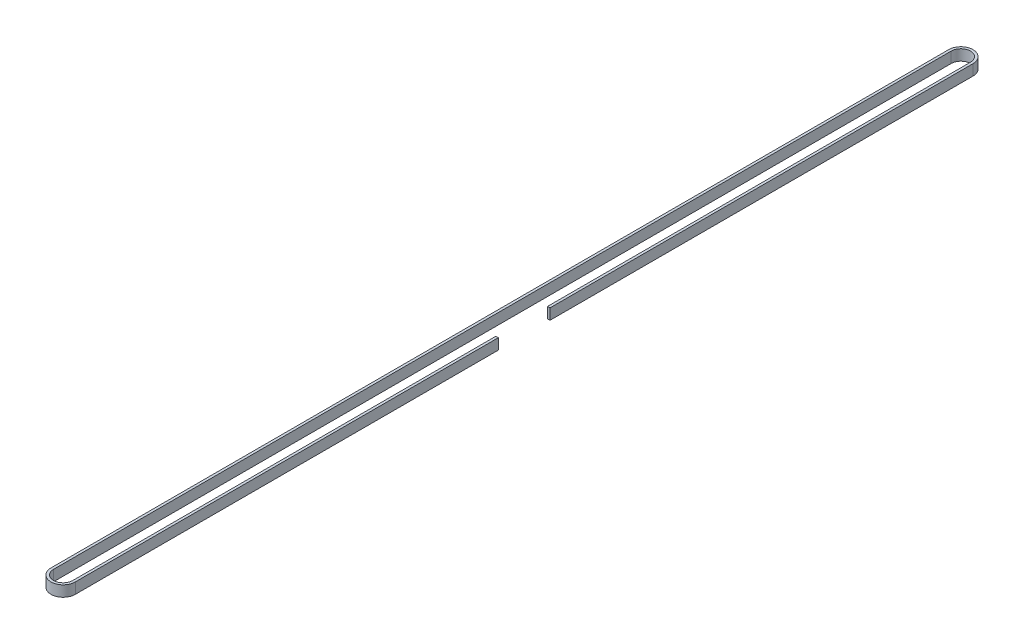
ISO-10303-21;
HEADER;
FILE_DESCRIPTION(('STEP AP214'),'2;1');
FILE_NAME('part.step','',(''),(''),'','','');
FILE_SCHEMA(('AUTOMOTIVE_DESIGN { 1 0 10303 214 1 1 1 1 }'));
ENDSEC;
DATA;
#1=APPLICATION_CONTEXT('core data for automotive mechanical design processes');
#2=APPLICATION_PROTOCOL_DEFINITION('international standard','automotive_design',2000,#1);
#3=PRODUCT_CONTEXT('',#1,'mechanical');
#4=PRODUCT('Part','Part','',(#3));
#5=PRODUCT_RELATED_PRODUCT_CATEGORY('part','',(#4));
#6=PRODUCT_DEFINITION_FORMATION('','',#4);
#7=PRODUCT_DEFINITION_CONTEXT('part definition',#1,'design');
#8=PRODUCT_DEFINITION('design','',#6,#7);
#9=PRODUCT_DEFINITION_SHAPE('','',#8);
#10=(LENGTH_UNIT() NAMED_UNIT(*) SI_UNIT(.MILLI.,.METRE.));
#11=(NAMED_UNIT(*) PLANE_ANGLE_UNIT() SI_UNIT($,.RADIAN.));
#12=(NAMED_UNIT(*) SI_UNIT($,.STERADIAN.) SOLID_ANGLE_UNIT());
#13=UNCERTAINTY_MEASURE_WITH_UNIT(LENGTH_MEASURE(1.E-05),#10,'distance_accuracy_value','');
#14=(GEOMETRIC_REPRESENTATION_CONTEXT(3) GLOBAL_UNCERTAINTY_ASSIGNED_CONTEXT((#13)) GLOBAL_UNIT_ASSIGNED_CONTEXT((#10,
#11,#12)) REPRESENTATION_CONTEXT('',''));
#15=CARTESIAN_POINT('',(0.,0.,0.));
#16=DIRECTION('',(0.,0.,1.));
#17=DIRECTION('',(1.,0.,0.));
#18=AXIS2_PLACEMENT_3D('',#15,#16,#17);
#19=CARTESIAN_POINT('',(357.126,6.,294.767481844307));
#20=DIRECTION('',(-1.,0.,0.));
#21=DIRECTION('',(0.,0.,1.));
#22=AXIS2_PLACEMENT_3D('',#19,#20,#21);
#23=PLANE('',#22);
#24=DIRECTION('',(0.,0.,-1.));
#25=VECTOR('',#24,1.);
#26=CARTESIAN_POINT('',(357.126,0.,294.767481844307));
#27=LINE('',#26,#25);
#28=CARTESIAN_POINT('',(357.126,0.,294.767481844307));
#29=VERTEX_POINT('',#28);
#30=CARTESIAN_POINT('',(357.126,0.,59.7674818443075));
#31=VERTEX_POINT('',#30);
#32=EDGE_CURVE('E170',#29,#31,#27,.T.);
#33=ORIENTED_EDGE('',*,*,#32,.T.);
#34=DIRECTION('',(0.,-1.,0.));
#35=VECTOR('',#34,1.);
#36=CARTESIAN_POINT('',(357.126,6.,59.7674818443075));
#37=LINE('',#36,#35);
#38=CARTESIAN_POINT('',(357.126,6.,59.7674818443075));
#39=VERTEX_POINT('',#38);
#40=EDGE_CURVE('E11',#39,#31,#37,.T.);
#41=ORIENTED_EDGE('',*,*,#40,.F.);
#42=DIRECTION('',(0.,0.,-1.));
#43=VECTOR('',#42,1.);
#44=CARTESIAN_POINT('',(357.126,6.,294.767481844307));
#45=LINE('',#44,#43);
#46=CARTESIAN_POINT('',(357.126,6.,294.767481844307));
#47=VERTEX_POINT('',#46);
#48=EDGE_CURVE('E114',#47,#39,#45,.T.);
#49=ORIENTED_EDGE('',*,*,#48,.F.);
#50=DIRECTION('',(0.,-1.,0.));
#51=VECTOR('',#50,1.);
#52=CARTESIAN_POINT('',(357.126,6.,294.767481844307));
#53=LINE('',#52,#51);
#54=EDGE_CURVE('E166',#47,#29,#53,.T.);
#55=ORIENTED_EDGE('',*,*,#54,.T.);
#56=EDGE_LOOP('',(#33,#41,#49,#55));
#57=FACE_BOUND('',#56,.T.);
#58=ADVANCED_FACE('F45',(#57),#23,.F.);
#59=CARTESIAN_POINT('',(355.746,6.,59.7674818443075));
#60=DIRECTION('',(0.,0.,-1.));
#61=DIRECTION('',(-1.,0.,0.));
#62=AXIS2_PLACEMENT_3D('',#59,#60,#61);
#63=PLANE('',#62);
#64=DIRECTION('',(1.,0.,0.));
#65=VECTOR('',#64,1.);
#66=CARTESIAN_POINT('',(355.746,0.,59.7674818443075));
#67=LINE('',#66,#65);
#68=CARTESIAN_POINT('',(355.746,0.,59.7674818443075));
#69=VERTEX_POINT('',#68);
#70=EDGE_CURVE('E174',#69,#31,#67,.T.);
#71=ORIENTED_EDGE('',*,*,#70,.F.);
#72=DIRECTION('',(0.,-1.,0.));
#73=VECTOR('',#72,1.);
#74=CARTESIAN_POINT('',(355.746,6.,59.7674818443075));
#75=LINE('',#74,#73);
#76=CARTESIAN_POINT('',(355.746,6.,59.7674818443075));
#77=VERTEX_POINT('',#76);
#78=EDGE_CURVE('E54',#77,#69,#75,.T.);
#79=ORIENTED_EDGE('',*,*,#78,.F.);
#80=DIRECTION('',(1.,0.,0.));
#81=VECTOR('',#80,1.);
#82=CARTESIAN_POINT('',(355.746,6.,59.7674818443075));
#83=LINE('',#82,#81);
#84=EDGE_CURVE('E257',#77,#39,#83,.T.);
#85=ORIENTED_EDGE('',*,*,#84,.T.);
#86=ORIENTED_EDGE('',*,*,#40,.T.);
#87=EDGE_LOOP('',(#71,#79,#85,#86));
#88=FACE_BOUND('',#87,.T.);
#89=ADVANCED_FACE('F244',(#88),#63,.T.);
#90=CARTESIAN_POINT('',(355.746,6.,294.767481844307));
#91=DIRECTION('',(-1.,0.,0.));
#92=DIRECTION('',(0.,0.,1.));
#93=AXIS2_PLACEMENT_3D('',#90,#91,#92);
#94=PLANE('',#93);
#95=DIRECTION('',(0.,0.,-1.));
#96=VECTOR('',#95,1.);
#97=CARTESIAN_POINT('',(355.746,0.,294.767481844307));
#98=LINE('',#97,#96);
#99=CARTESIAN_POINT('',(355.746,0.,294.767481844307));
#100=VERTEX_POINT('',#99);
#101=EDGE_CURVE('E178',#100,#69,#98,.T.);
#102=ORIENTED_EDGE('',*,*,#101,.F.);
#103=DIRECTION('',(0.,-1.,0.));
#104=VECTOR('',#103,1.);
#105=CARTESIAN_POINT('',(355.746,6.,294.767481844307));
#106=LINE('',#105,#104);
#107=CARTESIAN_POINT('',(355.746,6.,294.767481844307));
#108=VERTEX_POINT('',#107);
#109=EDGE_CURVE('E232',#108,#100,#106,.T.);
#110=ORIENTED_EDGE('',*,*,#109,.F.);
#111=DIRECTION('',(0.,0.,-1.));
#112=VECTOR('',#111,1.);
#113=CARTESIAN_POINT('',(355.746,6.,294.767481844307));
#114=LINE('',#113,#112);
#115=EDGE_CURVE('E241',#108,#77,#114,.T.);
#116=ORIENTED_EDGE('',*,*,#115,.T.);
#117=ORIENTED_EDGE('',*,*,#78,.T.);
#118=EDGE_LOOP('',(#102,#110,#116,#117));
#119=FACE_BOUND('',#118,.T.);
#120=ADVANCED_FACE('F239',(#119),#94,.T.);
#121=CARTESIAN_POINT('',(350.38,6.,294.767481844307));
#122=DIRECTION('',(0.,-1.,0.));
#123=DIRECTION('',(0.,0.,-1.));
#124=AXIS2_PLACEMENT_3D('',#121,#122,#123);
#125=CYLINDRICAL_SURFACE('',#124,5.36599999999999);
#126=CARTESIAN_POINT('',(350.38,0.,294.767481844307));
#127=DIRECTION('',(0.,1.,0.));
#128=DIRECTION('',(1.,0.,0.));
#129=AXIS2_PLACEMENT_3D('',#126,#127,#128);
#130=CIRCLE('',#129,5.36599999999999);
#131=CARTESIAN_POINT('',(345.014,0.,294.767481844307));
#132=VERTEX_POINT('',#131);
#133=EDGE_CURVE('E182',#132,#100,#130,.T.);
#134=ORIENTED_EDGE('',*,*,#133,.F.);
#135=DIRECTION('',(0.,-1.,0.));
#136=VECTOR('',#135,1.);
#137=CARTESIAN_POINT('',(345.014,6.,294.767481844307));
#138=LINE('',#137,#136);
#139=CARTESIAN_POINT('',(345.014,6.,294.767481844307));
#140=VERTEX_POINT('',#139);
#141=EDGE_CURVE('E229',#140,#132,#138,.T.);
#142=ORIENTED_EDGE('',*,*,#141,.F.);
#143=CARTESIAN_POINT('',(350.38,6.,294.767481844307));
#144=DIRECTION('',(0.,1.,0.));
#145=DIRECTION('',(1.,0.,0.));
#146=AXIS2_PLACEMENT_3D('',#143,#144,#145);
#147=CIRCLE('',#146,5.36599999999999);
#148=EDGE_CURVE('E254',#140,#108,#147,.T.);
#149=ORIENTED_EDGE('',*,*,#148,.T.);
#150=ORIENTED_EDGE('',*,*,#109,.T.);
#151=EDGE_LOOP('',(#134,#142,#149,#150));
#152=FACE_BOUND('',#151,.T.);
#153=ADVANCED_FACE('F251',(#152),#125,.F.);
#154=CARTESIAN_POINT('',(345.014,6.,294.767481844307));
#155=DIRECTION('',(1.,0.,0.));
#156=DIRECTION('',(0.,0.,-1.));
#157=AXIS2_PLACEMENT_3D('',#154,#155,#156);
#158=PLANE('',#157);
#159=DIRECTION('',(0.,0.,-1.));
#160=VECTOR('',#159,1.);
#161=CARTESIAN_POINT('',(345.014,0.,294.767481844307));
#162=LINE('',#161,#160);
#163=CARTESIAN_POINT('',(345.014,0.,-203.982518155693));
#164=VERTEX_POINT('',#163);
#165=EDGE_CURVE('E186',#164,#132,#162,.F.);
#166=ORIENTED_EDGE('',*,*,#165,.F.);
#167=DIRECTION('',(0.,-1.,0.));
#168=VECTOR('',#167,1.);
#169=CARTESIAN_POINT('',(345.014,6.,-203.982518155693));
#170=LINE('',#169,#168);
#171=CARTESIAN_POINT('',(345.014,6.,-203.982518155693));
#172=VERTEX_POINT('',#171);
#173=EDGE_CURVE('E226',#172,#164,#170,.T.);
#174=ORIENTED_EDGE('',*,*,#173,.F.);
#175=DIRECTION('',(0.,0.,-1.));
#176=VECTOR('',#175,1.);
#177=CARTESIAN_POINT('',(345.014,6.,294.767481844307));
#178=LINE('',#177,#176);
#179=EDGE_CURVE('E262',#172,#140,#178,.F.);
#180=ORIENTED_EDGE('',*,*,#179,.T.);
#181=ORIENTED_EDGE('',*,*,#141,.T.);
#182=EDGE_LOOP('',(#166,#174,#180,#181));
#183=FACE_BOUND('',#182,.T.);
#184=ADVANCED_FACE('F377',(#183),#158,.T.);
#185=CARTESIAN_POINT('',(350.38,6.,-203.982518155693));
#186=DIRECTION('',(0.,-1.,0.));
#187=DIRECTION('',(0.,0.,-1.));
#188=AXIS2_PLACEMENT_3D('',#185,#186,#187);
#189=CYLINDRICAL_SURFACE('',#188,5.36600000000001);
#190=CARTESIAN_POINT('',(350.38,0.,-203.982518155693));
#191=DIRECTION('',(0.,1.,0.));
#192=DIRECTION('',(1.,0.,0.));
#193=AXIS2_PLACEMENT_3D('',#190,#191,#192);
#194=CIRCLE('',#193,5.36600000000001);
#195=CARTESIAN_POINT('',(355.746,0.,-203.982518155693));
#196=VERTEX_POINT('',#195);
#197=EDGE_CURVE('E190',#196,#164,#194,.T.);
#198=ORIENTED_EDGE('',*,*,#197,.F.);
#199=DIRECTION('',(0.,-1.,0.));
#200=VECTOR('',#199,1.);
#201=CARTESIAN_POINT('',(355.746,6.,-203.982518155693));
#202=LINE('',#201,#200);
#203=CARTESIAN_POINT('',(355.746,6.,-203.982518155693));
#204=VERTEX_POINT('',#203);
#205=EDGE_CURVE('E223',#204,#196,#202,.T.);
#206=ORIENTED_EDGE('',*,*,#205,.F.);
#207=CARTESIAN_POINT('',(350.38,6.,-203.982518155693));
#208=DIRECTION('',(0.,1.,0.));
#209=DIRECTION('',(1.,0.,0.));
#210=AXIS2_PLACEMENT_3D('',#207,#208,#209);
#211=CIRCLE('',#210,5.36600000000001);
#212=EDGE_CURVE('E269',#204,#172,#211,.T.);
#213=ORIENTED_EDGE('',*,*,#212,.T.);
#214=ORIENTED_EDGE('',*,*,#173,.T.);
#215=EDGE_LOOP('',(#198,#206,#213,#214));
#216=FACE_BOUND('',#215,.T.);
#217=ADVANCED_FACE('F365',(#216),#189,.F.);
#218=CARTESIAN_POINT('',(355.746,6.,-203.982518155693));
#219=DIRECTION('',(-1.,0.,0.));
#220=DIRECTION('',(0.,0.,1.));
#221=AXIS2_PLACEMENT_3D('',#218,#219,#220);
#222=PLANE('',#221);
#223=DIRECTION('',(0.,0.,-1.));
#224=VECTOR('',#223,1.);
#225=CARTESIAN_POINT('',(355.746,0.,-203.982518155693));
#226=LINE('',#225,#224);
#227=CARTESIAN_POINT('',(355.746,0.,31.0174818443075));
#228=VERTEX_POINT('',#227);
#229=EDGE_CURVE('E194',#228,#196,#226,.T.);
#230=ORIENTED_EDGE('',*,*,#229,.F.);
#231=DIRECTION('',(0.,-1.,0.));
#232=VECTOR('',#231,1.);
#233=CARTESIAN_POINT('',(355.746,6.,31.0174818443075));
#234=LINE('',#233,#232);
#235=CARTESIAN_POINT('',(355.746,6.,31.0174818443075));
#236=VERTEX_POINT('',#235);
#237=EDGE_CURVE('E220',#236,#228,#234,.T.);
#238=ORIENTED_EDGE('',*,*,#237,.F.);
#239=DIRECTION('',(0.,0.,-1.));
#240=VECTOR('',#239,1.);
#241=CARTESIAN_POINT('',(355.746,6.,-203.982518155693));
#242=LINE('',#241,#240);
#243=EDGE_CURVE('E273',#236,#204,#242,.T.);
#244=ORIENTED_EDGE('',*,*,#243,.T.);
#245=ORIENTED_EDGE('',*,*,#205,.T.);
#246=EDGE_LOOP('',(#230,#238,#244,#245));
#247=FACE_BOUND('',#246,.T.);
#248=ADVANCED_FACE('F288',(#247),#222,.T.);
#249=CARTESIAN_POINT('',(357.126,6.,31.0174818443075));
#250=DIRECTION('',(0.,0.,1.));
#251=DIRECTION('',(1.,0.,0.));
#252=AXIS2_PLACEMENT_3D('',#249,#250,#251);
#253=PLANE('',#252);
#254=DIRECTION('',(-1.,0.,0.));
#255=VECTOR('',#254,1.);
#256=CARTESIAN_POINT('',(357.126,0.,31.0174818443075));
#257=LINE('',#256,#255);
#258=CARTESIAN_POINT('',(357.126,0.,31.0174818443075));
#259=VERTEX_POINT('',#258);
#260=EDGE_CURVE('E198',#259,#228,#257,.T.);
#261=ORIENTED_EDGE('',*,*,#260,.F.);
#262=DIRECTION('',(0.,-1.,0.));
#263=VECTOR('',#262,1.);
#264=CARTESIAN_POINT('',(357.126,6.,31.0174818443075));
#265=LINE('',#264,#263);
#266=CARTESIAN_POINT('',(357.126,6.,31.0174818443075));
#267=VERTEX_POINT('',#266);
#268=EDGE_CURVE('E217',#267,#259,#265,.T.);
#269=ORIENTED_EDGE('',*,*,#268,.F.);
#270=DIRECTION('',(-1.,0.,0.));
#271=VECTOR('',#270,1.);
#272=CARTESIAN_POINT('',(357.126,6.,31.0174818443075));
#273=LINE('',#272,#271);
#274=EDGE_CURVE('E277',#267,#236,#273,.T.);
#275=ORIENTED_EDGE('',*,*,#274,.T.);
#276=ORIENTED_EDGE('',*,*,#237,.T.);
#277=EDGE_LOOP('',(#261,#269,#275,#276));
#278=FACE_BOUND('',#277,.T.);
#279=ADVANCED_FACE('F283',(#278),#253,.T.);
#280=CARTESIAN_POINT('',(357.126,6.,-203.982518155693));
#281=DIRECTION('',(-1.,0.,0.));
#282=DIRECTION('',(0.,0.,1.));
#283=AXIS2_PLACEMENT_3D('',#280,#281,#282);
#284=PLANE('',#283);
#285=DIRECTION('',(0.,0.,-1.));
#286=VECTOR('',#285,1.);
#287=CARTESIAN_POINT('',(357.126,0.,-203.982518155693));
#288=LINE('',#287,#286);
#289=CARTESIAN_POINT('',(357.126,0.,-203.982518155693));
#290=VERTEX_POINT('',#289);
#291=EDGE_CURVE('E202',#259,#290,#288,.T.);
#292=ORIENTED_EDGE('',*,*,#291,.T.);
#293=DIRECTION('',(0.,-1.,0.));
#294=VECTOR('',#293,1.);
#295=CARTESIAN_POINT('',(357.126,6.,-203.982518155693));
#296=LINE('',#295,#294);
#297=CARTESIAN_POINT('',(357.126,6.,-203.982518155693));
#298=VERTEX_POINT('',#297);
#299=EDGE_CURVE('E159',#298,#290,#296,.T.);
#300=ORIENTED_EDGE('',*,*,#299,.F.);
#301=DIRECTION('',(0.,0.,-1.));
#302=VECTOR('',#301,1.);
#303=CARTESIAN_POINT('',(357.126,6.,-203.982518155693));
#304=LINE('',#303,#302);
#305=EDGE_CURVE('E148',#267,#298,#304,.T.);
#306=ORIENTED_EDGE('',*,*,#305,.F.);
#307=ORIENTED_EDGE('',*,*,#268,.T.);
#308=EDGE_LOOP('',(#292,#300,#306,#307));
#309=FACE_BOUND('',#308,.T.);
#310=ADVANCED_FACE('F292',(#309),#284,.F.);
#311=CARTESIAN_POINT('',(350.38,6.,-203.982518155693));
#312=DIRECTION('',(0.,-1.,0.));
#313=DIRECTION('',(0.,0.,-1.));
#314=AXIS2_PLACEMENT_3D('',#311,#312,#313);
#315=CYLINDRICAL_SURFACE('',#314,6.74600000000001);
#316=CARTESIAN_POINT('',(350.38,0.,-203.982518155693));
#317=DIRECTION('',(0.,1.,0.));
#318=DIRECTION('',(1.,0.,0.));
#319=AXIS2_PLACEMENT_3D('',#316,#317,#318);
#320=CIRCLE('',#319,6.74600000000001);
#321=CARTESIAN_POINT('',(343.634,0.,-203.982518155693));
#322=VERTEX_POINT('',#321);
#323=EDGE_CURVE('E157',#290,#322,#320,.T.);
#324=ORIENTED_EDGE('',*,*,#323,.T.);
#325=DIRECTION('',(0.,-1.,0.));
#326=VECTOR('',#325,1.);
#327=CARTESIAN_POINT('',(343.634,6.,-203.982518155693));
#328=LINE('',#327,#326);
#329=CARTESIAN_POINT('',(343.634,6.,-203.982518155693));
#330=VERTEX_POINT('',#329);
#331=EDGE_CURVE('E154',#330,#322,#328,.T.);
#332=ORIENTED_EDGE('',*,*,#331,.F.);
#333=CARTESIAN_POINT('',(350.38,6.,-203.982518155693));
#334=DIRECTION('',(0.,1.,0.));
#335=DIRECTION('',(1.,0.,0.));
#336=AXIS2_PLACEMENT_3D('',#333,#334,#335);
#337=CIRCLE('',#336,6.74600000000001);
#338=EDGE_CURVE('E141',#298,#330,#337,.T.);
#339=ORIENTED_EDGE('',*,*,#338,.F.);
#340=ORIENTED_EDGE('',*,*,#299,.T.);
#341=EDGE_LOOP('',(#324,#332,#339,#340));
#342=FACE_BOUND('',#341,.T.);
#343=ADVANCED_FACE('F155',(#342),#315,.T.);
#344=CARTESIAN_POINT('',(343.634,6.,294.767481844307));
#345=DIRECTION('',(1.,0.,0.));
#346=DIRECTION('',(0.,0.,-1.));
#347=AXIS2_PLACEMENT_3D('',#344,#345,#346);
#348=PLANE('',#347);
#349=DIRECTION('',(0.,0.,-1.));
#350=VECTOR('',#349,1.);
#351=CARTESIAN_POINT('',(343.634,0.,294.767481844307));
#352=LINE('',#351,#350);
#353=CARTESIAN_POINT('',(343.634,0.,294.767481844307));
#354=VERTEX_POINT('',#353);
#355=EDGE_CURVE('E102',#322,#354,#352,.F.);
#356=ORIENTED_EDGE('',*,*,#355,.T.);
#357=DIRECTION('',(0.,-1.,0.));
#358=VECTOR('',#357,1.);
#359=CARTESIAN_POINT('',(343.634,6.,294.767481844307));
#360=LINE('',#359,#358);
#361=CARTESIAN_POINT('',(343.634,6.,294.767481844307));
#362=VERTEX_POINT('',#361);
#363=EDGE_CURVE('E160',#362,#354,#360,.T.);
#364=ORIENTED_EDGE('',*,*,#363,.F.);
#365=DIRECTION('',(0.,0.,-1.));
#366=VECTOR('',#365,1.);
#367=CARTESIAN_POINT('',(343.634,6.,294.767481844307));
#368=LINE('',#367,#366);
#369=EDGE_CURVE('E145',#330,#362,#368,.F.);
#370=ORIENTED_EDGE('',*,*,#369,.F.);
#371=ORIENTED_EDGE('',*,*,#331,.T.);
#372=EDGE_LOOP('',(#356,#364,#370,#371));
#373=FACE_BOUND('',#372,.T.);
#374=ADVANCED_FACE('F162',(#373),#348,.F.);
#375=CARTESIAN_POINT('',(350.38,6.,294.767481844307));
#376=DIRECTION('',(0.,-1.,0.));
#377=DIRECTION('',(0.,0.,-1.));
#378=AXIS2_PLACEMENT_3D('',#375,#376,#377);
#379=CYLINDRICAL_SURFACE('',#378,6.74599999999999);
#380=CARTESIAN_POINT('',(350.38,0.,294.767481844307));
#381=DIRECTION('',(0.,1.,0.));
#382=DIRECTION('',(1.,0.,0.));
#383=AXIS2_PLACEMENT_3D('',#380,#381,#382);
#384=CIRCLE('',#383,6.74599999999999);
#385=EDGE_CURVE('E108',#354,#29,#384,.T.);
#386=ORIENTED_EDGE('',*,*,#385,.T.);
#387=ORIENTED_EDGE('',*,*,#54,.F.);
#388=CARTESIAN_POINT('',(350.38,6.,294.767481844307));
#389=DIRECTION('',(0.,1.,0.));
#390=DIRECTION('',(1.,0.,0.));
#391=AXIS2_PLACEMENT_3D('',#388,#389,#390);
#392=CIRCLE('',#391,6.74599999999999);
#393=EDGE_CURVE('E62',#362,#47,#392,.T.);
#394=ORIENTED_EDGE('',*,*,#393,.F.);
#395=ORIENTED_EDGE('',*,*,#363,.T.);
#396=EDGE_LOOP('',(#386,#387,#394,#395));
#397=FACE_BOUND('',#396,.T.);
#398=ADVANCED_FACE('F306',(#397),#379,.T.);
#399=CARTESIAN_POINT('',(350.38,6.,294.767481844307));
#400=DIRECTION('',(0.,1.,0.));
#401=DIRECTION('',(1.,0.,0.));
#402=AXIS2_PLACEMENT_3D('',#399,#400,#401);
#403=PLANE('',#402);
#404=ORIENTED_EDGE('',*,*,#48,.T.);
#405=ORIENTED_EDGE('',*,*,#84,.F.);
#406=ORIENTED_EDGE('',*,*,#115,.F.);
#407=ORIENTED_EDGE('',*,*,#148,.F.);
#408=ORIENTED_EDGE('',*,*,#179,.F.);
#409=ORIENTED_EDGE('',*,*,#212,.F.);
#410=ORIENTED_EDGE('',*,*,#243,.F.);
#411=ORIENTED_EDGE('',*,*,#274,.F.);
#412=ORIENTED_EDGE('',*,*,#305,.T.);
#413=ORIENTED_EDGE('',*,*,#338,.T.);
#414=ORIENTED_EDGE('',*,*,#369,.T.);
#415=ORIENTED_EDGE('',*,*,#393,.T.);
#416=EDGE_LOOP('',(#404,#405,#406,#407,#408,#409,#410,#411,#412,#413,#414,#415));
#417=FACE_BOUND('',#416,.T.);
#418=ADVANCED_FACE('F143',(#417),#403,.T.);
#419=CARTESIAN_POINT('',(350.38,0.,294.767481844307));
#420=DIRECTION('',(0.,1.,0.));
#421=DIRECTION('',(1.,0.,0.));
#422=AXIS2_PLACEMENT_3D('',#419,#420,#421);
#423=PLANE('',#422);
#424=ORIENTED_EDGE('',*,*,#32,.F.);
#425=ORIENTED_EDGE('',*,*,#385,.F.);
#426=ORIENTED_EDGE('',*,*,#355,.F.);
#427=ORIENTED_EDGE('',*,*,#323,.F.);
#428=ORIENTED_EDGE('',*,*,#291,.F.);
#429=ORIENTED_EDGE('',*,*,#260,.T.);
#430=ORIENTED_EDGE('',*,*,#229,.T.);
#431=ORIENTED_EDGE('',*,*,#197,.T.);
#432=ORIENTED_EDGE('',*,*,#165,.T.);
#433=ORIENTED_EDGE('',*,*,#133,.T.);
#434=ORIENTED_EDGE('',*,*,#101,.T.);
#435=ORIENTED_EDGE('',*,*,#70,.T.);
#436=EDGE_LOOP('',(#424,#425,#426,#427,#428,#429,#430,#431,#432,#433,#434,#435));
#437=FACE_BOUND('',#436,.T.);
#438=ADVANCED_FACE('F247',(#437),#423,.F.);
#439=CLOSED_SHELL('',(#58,#89,#120,#153,#184,#217,#248,#279,#310,#343,#374,#398,#418,#438));
#440=MANIFOLD_SOLID_BREP('B2',#439);
#441=ADVANCED_BREP_SHAPE_REPRESENTATION('',(#18,#440),#14);
#442=SHAPE_DEFINITION_REPRESENTATION(#9,#441);
ENDSEC;
END-ISO-10303-21;
